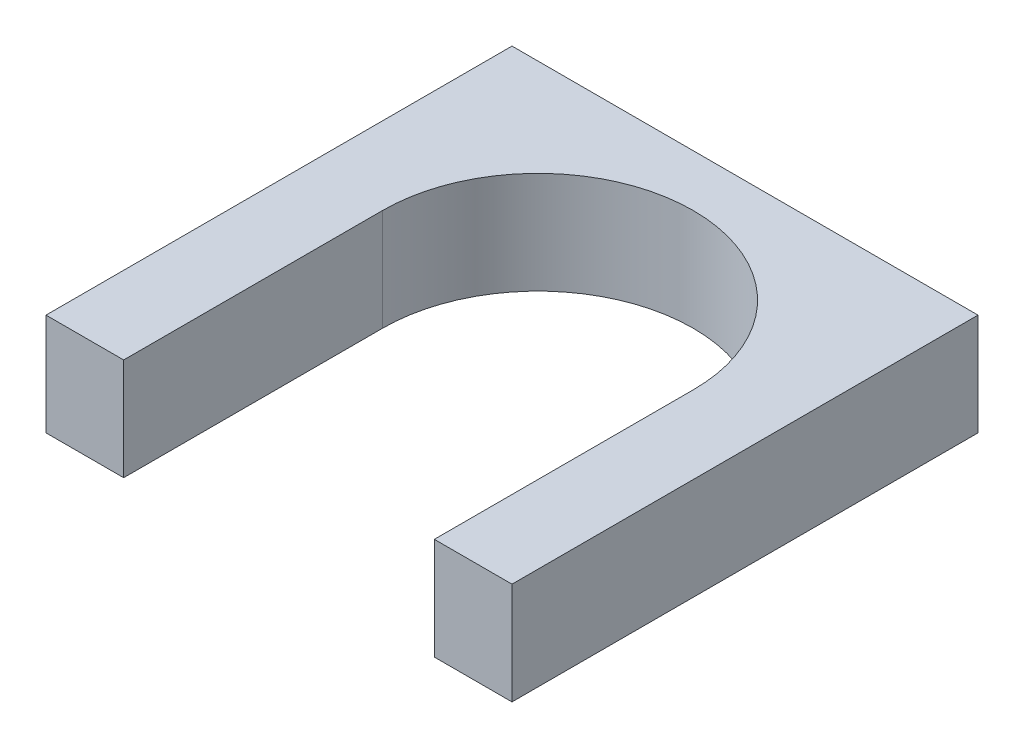
ISO-10303-21;
HEADER;
FILE_DESCRIPTION(('STEP AP214'),'2;1');
FILE_NAME('part.step','',(''),(''),'','','');
FILE_SCHEMA(('AUTOMOTIVE_DESIGN { 1 0 10303 214 1 1 1 1 }'));
ENDSEC;
DATA;
#1=APPLICATION_CONTEXT('core data for automotive mechanical design processes');
#2=APPLICATION_PROTOCOL_DEFINITION('international standard','automotive_design',2000,#1);
#3=PRODUCT_CONTEXT('',#1,'mechanical');
#4=PRODUCT('Part','Part','',(#3));
#5=PRODUCT_RELATED_PRODUCT_CATEGORY('part','',(#4));
#6=PRODUCT_DEFINITION_FORMATION('','',#4);
#7=PRODUCT_DEFINITION_CONTEXT('part definition',#1,'design');
#8=PRODUCT_DEFINITION('design','',#6,#7);
#9=PRODUCT_DEFINITION_SHAPE('','',#8);
#10=(LENGTH_UNIT() NAMED_UNIT(*) SI_UNIT(.MILLI.,.METRE.));
#11=(NAMED_UNIT(*) PLANE_ANGLE_UNIT() SI_UNIT($,.RADIAN.));
#12=(NAMED_UNIT(*) SI_UNIT($,.STERADIAN.) SOLID_ANGLE_UNIT());
#13=UNCERTAINTY_MEASURE_WITH_UNIT(LENGTH_MEASURE(1.E-05),#10,'distance_accuracy_value','');
#14=(GEOMETRIC_REPRESENTATION_CONTEXT(3) GLOBAL_UNCERTAINTY_ASSIGNED_CONTEXT((#13)) GLOBAL_UNIT_ASSIGNED_CONTEXT((#10,
#11,#12)) REPRESENTATION_CONTEXT('',''));
#15=CARTESIAN_POINT('',(0.,0.,0.));
#16=DIRECTION('',(0.,0.,1.));
#17=DIRECTION('',(1.,0.,0.));
#18=AXIS2_PLACEMENT_3D('',#15,#16,#17);
#19=CARTESIAN_POINT('',(0.,0.,90.));
#20=DIRECTION('',(0.,0.,-1.));
#21=DIRECTION('',(-1.,0.,0.));
#22=AXIS2_PLACEMENT_3D('',#19,#20,#21);
#23=PLANE('',#22);
#24=DIRECTION('',(-1.,0.,0.));
#25=VECTOR('',#24,1.);
#26=CARTESIAN_POINT('',(-49.1019351531462,19.7,90.));
#27=LINE('',#26,#25);
#28=CARTESIAN_POINT('',(40.8980648468538,19.7,90.));
#29=VERTEX_POINT('',#28);
#30=CARTESIAN_POINT('',(25.8980648468538,19.7,90.));
#31=VERTEX_POINT('',#30);
#32=EDGE_CURVE('E142',#29,#31,#27,.T.);
#33=ORIENTED_EDGE('',*,*,#32,.T.);
#34=DIRECTION('',(0.,-1.,0.));
#35=VECTOR('',#34,1.);
#36=CARTESIAN_POINT('',(25.8980648468538,0.,90.));
#37=LINE('',#36,#35);
#38=CARTESIAN_POINT('',(25.8980648468538,0.,90.));
#39=VERTEX_POINT('',#38);
#40=EDGE_CURVE('E11',#31,#39,#37,.T.);
#41=ORIENTED_EDGE('',*,*,#40,.T.);
#42=DIRECTION('',(1.,0.,0.));
#43=VECTOR('',#42,1.);
#44=CARTESIAN_POINT('',(-49.1019351531462,0.,90.));
#45=LINE('',#44,#43);
#46=CARTESIAN_POINT('',(40.8980648468538,0.,90.));
#47=VERTEX_POINT('',#46);
#48=EDGE_CURVE('E138',#39,#47,#45,.T.);
#49=ORIENTED_EDGE('',*,*,#48,.T.);
#50=DIRECTION('',(0.,1.,0.));
#51=VECTOR('',#50,1.);
#52=CARTESIAN_POINT('',(40.8980648468538,19.7,90.));
#53=LINE('',#52,#51);
#54=EDGE_CURVE('E140',#47,#29,#53,.T.);
#55=ORIENTED_EDGE('',*,*,#54,.T.);
#56=EDGE_LOOP('',(#33,#41,#49,#55));
#57=FACE_BOUND('',#56,.T.);
#58=ADVANCED_FACE('F34',(#57),#23,.F.);
#59=CARTESIAN_POINT('',(-49.1019351531462,0.,90.));
#60=DIRECTION('',(1.,0.,0.));
#61=DIRECTION('',(0.,0.,-1.));
#62=AXIS2_PLACEMENT_3D('',#59,#60,#61);
#63=PLANE('',#62);
#64=DIRECTION('',(0.,-1.,0.));
#65=VECTOR('',#64,1.);
#66=CARTESIAN_POINT('',(-49.1019351531462,0.,0.));
#67=LINE('',#66,#65);
#68=CARTESIAN_POINT('',(-49.1019351531462,19.7,0.));
#69=VERTEX_POINT('',#68);
#70=CARTESIAN_POINT('',(-49.1019351531462,0.,0.));
#71=VERTEX_POINT('',#70);
#72=EDGE_CURVE('E135',#69,#71,#67,.T.);
#73=ORIENTED_EDGE('',*,*,#72,.T.);
#74=DIRECTION('',(0.,0.,-1.));
#75=VECTOR('',#74,1.);
#76=CARTESIAN_POINT('',(-49.1019351531462,0.,90.));
#77=LINE('',#76,#75);
#78=CARTESIAN_POINT('',(-49.1019351531462,0.,90.));
#79=VERTEX_POINT('',#78);
#80=EDGE_CURVE('E159',#79,#71,#77,.T.);
#81=ORIENTED_EDGE('',*,*,#80,.F.);
#82=DIRECTION('',(0.,-1.,0.));
#83=VECTOR('',#82,1.);
#84=CARTESIAN_POINT('',(-49.1019351531462,0.,90.));
#85=LINE('',#84,#83);
#86=CARTESIAN_POINT('',(-49.1019351531462,19.7,90.));
#87=VERTEX_POINT('',#86);
#88=EDGE_CURVE('E136',#87,#79,#85,.T.);
#89=ORIENTED_EDGE('',*,*,#88,.F.);
#90=DIRECTION('',(0.,0.,-1.));
#91=VECTOR('',#90,1.);
#92=CARTESIAN_POINT('',(-49.1019351531462,19.7,90.));
#93=LINE('',#92,#91);
#94=EDGE_CURVE('E145',#87,#69,#93,.T.);
#95=ORIENTED_EDGE('',*,*,#94,.T.);
#96=EDGE_LOOP('',(#73,#81,#89,#95));
#97=FACE_BOUND('',#96,.T.);
#98=ADVANCED_FACE('F36',(#97),#63,.F.);
#99=CARTESIAN_POINT('',(-49.1019351531462,0.,90.));
#100=DIRECTION('',(0.,1.,0.));
#101=DIRECTION('',(0.,0.,1.));
#102=AXIS2_PLACEMENT_3D('',#99,#100,#101);
#103=PLANE('',#102);
#104=ORIENTED_EDGE('',*,*,#48,.F.);
#105=DIRECTION('',(0.,0.,-1.));
#106=VECTOR('',#105,1.);
#107=CARTESIAN_POINT('',(25.8980648468537,0.,90.));
#108=LINE('',#107,#106);
#109=CARTESIAN_POINT('',(25.8980648468538,0.,40.));
#110=VERTEX_POINT('',#109);
#111=EDGE_CURVE('E130',#39,#110,#108,.T.);
#112=ORIENTED_EDGE('',*,*,#111,.T.);
#113=CARTESIAN_POINT('',(-4.10193515314625,0.,40.));
#114=DIRECTION('',(0.,1.,0.));
#115=DIRECTION('',(0.,0.,1.));
#116=AXIS2_PLACEMENT_3D('',#113,#114,#115);
#117=CIRCLE('',#116,30.);
#118=CARTESIAN_POINT('',(-34.1019351531462,0.,40.));
#119=VERTEX_POINT('',#118);
#120=EDGE_CURVE('E133',#110,#119,#117,.T.);
#121=ORIENTED_EDGE('',*,*,#120,.T.);
#122=DIRECTION('',(0.,0.,1.));
#123=VECTOR('',#122,1.);
#124=CARTESIAN_POINT('',(-34.1019351531462,0.,90.));
#125=LINE('',#124,#123);
#126=CARTESIAN_POINT('',(-34.1019351531462,0.,90.));
#127=VERTEX_POINT('',#126);
#128=EDGE_CURVE('E111',#119,#127,#125,.T.);
#129=ORIENTED_EDGE('',*,*,#128,.T.);
#130=EDGE_CURVE('E87',#79,#127,#45,.T.);
#131=ORIENTED_EDGE('',*,*,#130,.F.);
#132=ORIENTED_EDGE('',*,*,#80,.T.);
#133=DIRECTION('',(1.,0.,0.));
#134=VECTOR('',#133,1.);
#135=CARTESIAN_POINT('',(-49.1019351531462,0.,0.));
#136=LINE('',#135,#134);
#137=CARTESIAN_POINT('',(40.8980648468538,0.,0.));
#138=VERTEX_POINT('',#137);
#139=EDGE_CURVE('E148',#71,#138,#136,.T.);
#140=ORIENTED_EDGE('',*,*,#139,.T.);
#141=DIRECTION('',(0.,0.,-1.));
#142=VECTOR('',#141,1.);
#143=CARTESIAN_POINT('',(40.8980648468538,0.,90.));
#144=LINE('',#143,#142);
#145=EDGE_CURVE('E156',#47,#138,#144,.T.);
#146=ORIENTED_EDGE('',*,*,#145,.F.);
#147=EDGE_LOOP('',(#104,#112,#121,#129,#131,#132,#140,#146));
#148=FACE_BOUND('',#147,.T.);
#149=ADVANCED_FACE('F162',(#148),#103,.F.);
#150=CARTESIAN_POINT('',(40.8980648468538,19.7,90.));
#151=DIRECTION('',(-1.,0.,0.));
#152=DIRECTION('',(0.,0.,1.));
#153=AXIS2_PLACEMENT_3D('',#150,#151,#152);
#154=PLANE('',#153);
#155=DIRECTION('',(0.,1.,0.));
#156=VECTOR('',#155,1.);
#157=CARTESIAN_POINT('',(40.8980648468538,19.7,0.));
#158=LINE('',#157,#156);
#159=CARTESIAN_POINT('',(40.8980648468538,19.7,0.));
#160=VERTEX_POINT('',#159);
#161=EDGE_CURVE('E150',#138,#160,#158,.T.);
#162=ORIENTED_EDGE('',*,*,#161,.T.);
#163=DIRECTION('',(0.,0.,-1.));
#164=VECTOR('',#163,1.);
#165=CARTESIAN_POINT('',(40.8980648468538,19.7,90.));
#166=LINE('',#165,#164);
#167=EDGE_CURVE('E154',#29,#160,#166,.T.);
#168=ORIENTED_EDGE('',*,*,#167,.F.);
#169=ORIENTED_EDGE('',*,*,#54,.F.);
#170=ORIENTED_EDGE('',*,*,#145,.T.);
#171=EDGE_LOOP('',(#162,#168,#169,#170));
#172=FACE_BOUND('',#171,.T.);
#173=ADVANCED_FACE('F171',(#172),#154,.F.);
#174=CARTESIAN_POINT('',(-49.1019351531462,19.7,90.));
#175=DIRECTION('',(0.,-1.,0.));
#176=DIRECTION('',(0.,0.,-1.));
#177=AXIS2_PLACEMENT_3D('',#174,#175,#176);
#178=PLANE('',#177);
#179=CARTESIAN_POINT('',(-4.10193515314625,19.7,40.));
#180=DIRECTION('',(0.,1.,0.));
#181=DIRECTION('',(0.,0.,1.));
#182=AXIS2_PLACEMENT_3D('',#179,#180,#181);
#183=CIRCLE('',#182,30.);
#184=CARTESIAN_POINT('',(25.8980648468538,19.7,40.));
#185=VERTEX_POINT('',#184);
#186=CARTESIAN_POINT('',(-34.1019351531462,19.7,40.));
#187=VERTEX_POINT('',#186);
#188=EDGE_CURVE('E118',#185,#187,#183,.T.);
#189=ORIENTED_EDGE('',*,*,#188,.F.);
#190=DIRECTION('',(0.,0.,-1.));
#191=VECTOR('',#190,1.);
#192=CARTESIAN_POINT('',(25.8980648468538,19.7,90.));
#193=LINE('',#192,#191);
#194=EDGE_CURVE('E115',#31,#185,#193,.T.);
#195=ORIENTED_EDGE('',*,*,#194,.F.);
#196=ORIENTED_EDGE('',*,*,#32,.F.);
#197=ORIENTED_EDGE('',*,*,#167,.T.);
#198=DIRECTION('',(-1.,0.,0.));
#199=VECTOR('',#198,1.);
#200=CARTESIAN_POINT('',(-49.1019351531462,19.7,0.));
#201=LINE('',#200,#199);
#202=EDGE_CURVE('E79',#160,#69,#201,.T.);
#203=ORIENTED_EDGE('',*,*,#202,.T.);
#204=ORIENTED_EDGE('',*,*,#94,.F.);
#205=CARTESIAN_POINT('',(-34.1019351531462,19.7,90.));
#206=VERTEX_POINT('',#205);
#207=EDGE_CURVE('E57',#206,#87,#27,.T.);
#208=ORIENTED_EDGE('',*,*,#207,.F.);
#209=DIRECTION('',(0.,0.,1.));
#210=VECTOR('',#209,1.);
#211=CARTESIAN_POINT('',(-34.1019351531462,19.7,40.));
#212=LINE('',#211,#210);
#213=EDGE_CURVE('E49',#187,#206,#212,.T.);
#214=ORIENTED_EDGE('',*,*,#213,.F.);
#215=EDGE_LOOP('',(#189,#195,#196,#197,#203,#204,#208,#214));
#216=FACE_BOUND('',#215,.T.);
#217=ADVANCED_FACE('F124',(#216),#178,.F.);
#218=ORIENTED_EDGE('',*,*,#130,.T.);
#219=DIRECTION('',(0.,1.,0.));
#220=VECTOR('',#219,1.);
#221=CARTESIAN_POINT('',(-34.1019351531462,0.,90.));
#222=LINE('',#221,#220);
#223=EDGE_CURVE('E42',#127,#206,#222,.T.);
#224=ORIENTED_EDGE('',*,*,#223,.T.);
#225=ORIENTED_EDGE('',*,*,#207,.T.);
#226=ORIENTED_EDGE('',*,*,#88,.T.);
#227=EDGE_LOOP('',(#218,#224,#225,#226));
#228=FACE_BOUND('',#227,.T.);
#229=ADVANCED_FACE('F160',(#228),#23,.F.);
#230=CARTESIAN_POINT('',(0.,0.,0.));
#231=DIRECTION('',(0.,0.,-1.));
#232=DIRECTION('',(-1.,0.,0.));
#233=AXIS2_PLACEMENT_3D('',#230,#231,#232);
#234=PLANE('',#233);
#235=ORIENTED_EDGE('',*,*,#72,.F.);
#236=ORIENTED_EDGE('',*,*,#202,.F.);
#237=ORIENTED_EDGE('',*,*,#161,.F.);
#238=ORIENTED_EDGE('',*,*,#139,.F.);
#239=EDGE_LOOP('',(#235,#236,#237,#238));
#240=FACE_BOUND('',#239,.T.);
#241=ADVANCED_FACE('F175',(#240),#234,.T.);
#242=CARTESIAN_POINT('',(-4.10193515314625,-10.3,40.));
#243=DIRECTION('',(0.,1.,0.));
#244=DIRECTION('',(0.,0.,1.));
#245=AXIS2_PLACEMENT_3D('',#242,#243,#244);
#246=CYLINDRICAL_SURFACE('',#245,30.);
#247=DIRECTION('',(0.,1.,0.));
#248=VECTOR('',#247,1.);
#249=CARTESIAN_POINT('',(25.8980648468538,-10.3,40.));
#250=LINE('',#249,#248);
#251=EDGE_CURVE('E114',#110,#185,#250,.T.);
#252=ORIENTED_EDGE('',*,*,#251,.T.);
#253=ORIENTED_EDGE('',*,*,#188,.T.);
#254=DIRECTION('',(0.,1.,0.));
#255=VECTOR('',#254,1.);
#256=CARTESIAN_POINT('',(-34.1019351531462,-10.3,40.));
#257=LINE('',#256,#255);
#258=EDGE_CURVE('E108',#119,#187,#257,.T.);
#259=ORIENTED_EDGE('',*,*,#258,.F.);
#260=ORIENTED_EDGE('',*,*,#120,.F.);
#261=EDGE_LOOP('',(#252,#253,#259,#260));
#262=FACE_BOUND('',#261,.T.);
#263=ADVANCED_FACE('F119',(#262),#246,.F.);
#264=CARTESIAN_POINT('',(25.8980648468538,-10.3,90.));
#265=DIRECTION('',(1.,0.,0.));
#266=DIRECTION('',(0.,0.,-1.));
#267=AXIS2_PLACEMENT_3D('',#264,#265,#266);
#268=PLANE('',#267);
#269=ORIENTED_EDGE('',*,*,#40,.F.);
#270=ORIENTED_EDGE('',*,*,#194,.T.);
#271=ORIENTED_EDGE('',*,*,#251,.F.);
#272=ORIENTED_EDGE('',*,*,#111,.F.);
#273=EDGE_LOOP('',(#269,#270,#271,#272));
#274=FACE_BOUND('',#273,.T.);
#275=ADVANCED_FACE('F164',(#274),#268,.F.);
#276=CARTESIAN_POINT('',(-34.1019351531462,-10.3,40.));
#277=DIRECTION('',(-1.,0.,0.));
#278=DIRECTION('',(0.,0.,1.));
#279=AXIS2_PLACEMENT_3D('',#276,#277,#278);
#280=PLANE('',#279);
#281=ORIENTED_EDGE('',*,*,#258,.T.);
#282=ORIENTED_EDGE('',*,*,#213,.T.);
#283=ORIENTED_EDGE('',*,*,#223,.F.);
#284=ORIENTED_EDGE('',*,*,#128,.F.);
#285=EDGE_LOOP('',(#281,#282,#283,#284));
#286=FACE_BOUND('',#285,.T.);
#287=ADVANCED_FACE('F110',(#286),#280,.F.);
#288=CLOSED_SHELL('',(#58,#98,#149,#173,#217,#229,#241,#263,#275,#287));
#289=MANIFOLD_SOLID_BREP('B2',#288);
#290=ADVANCED_BREP_SHAPE_REPRESENTATION('',(#18,#289),#14);
#291=SHAPE_DEFINITION_REPRESENTATION(#9,#290);
ENDSEC;
END-ISO-10303-21;
